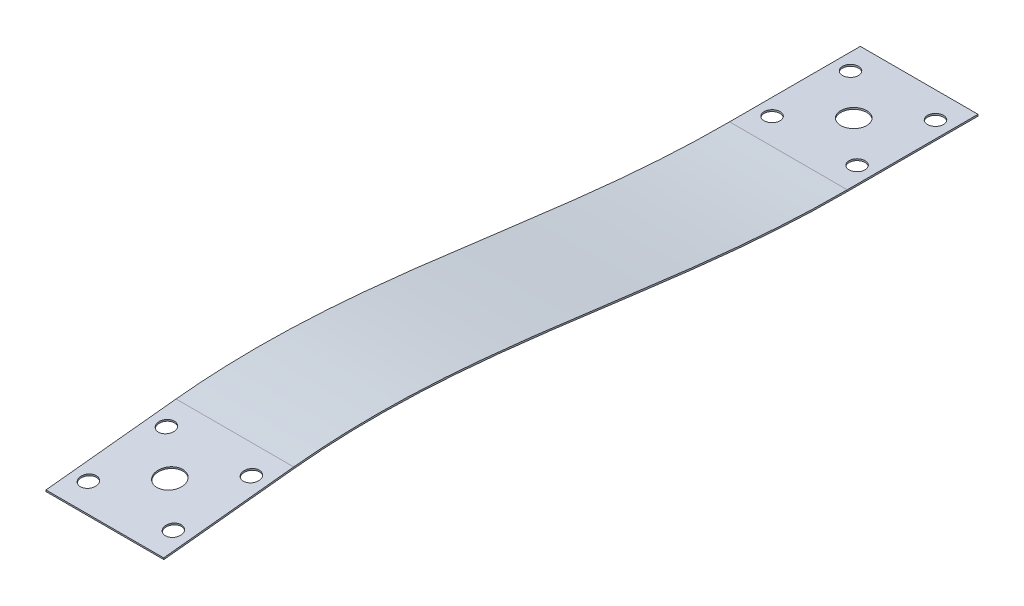
ISO-10303-21;
HEADER;
FILE_DESCRIPTION(('STEP AP214'),'2;1');
FILE_NAME('part.step','',(''),(''),'','','');
FILE_SCHEMA(('AUTOMOTIVE_DESIGN { 1 0 10303 214 1 1 1 1 }'));
ENDSEC;
DATA;
#1=APPLICATION_CONTEXT('core data for automotive mechanical design processes');
#2=APPLICATION_PROTOCOL_DEFINITION('international standard','automotive_design',2000,#1);
#3=PRODUCT_CONTEXT('',#1,'mechanical');
#4=PRODUCT('Part','Part','',(#3));
#5=PRODUCT_RELATED_PRODUCT_CATEGORY('part','',(#4));
#6=PRODUCT_DEFINITION_FORMATION('','',#4);
#7=PRODUCT_DEFINITION_CONTEXT('part definition',#1,'design');
#8=PRODUCT_DEFINITION('design','',#6,#7);
#9=PRODUCT_DEFINITION_SHAPE('','',#8);
#10=(LENGTH_UNIT() NAMED_UNIT(*) SI_UNIT(.MILLI.,.METRE.));
#11=(NAMED_UNIT(*) PLANE_ANGLE_UNIT() SI_UNIT($,.RADIAN.));
#12=(NAMED_UNIT(*) SI_UNIT($,.STERADIAN.) SOLID_ANGLE_UNIT());
#13=UNCERTAINTY_MEASURE_WITH_UNIT(LENGTH_MEASURE(1.E-05),#10,'distance_accuracy_value','');
#14=(GEOMETRIC_REPRESENTATION_CONTEXT(3) GLOBAL_UNCERTAINTY_ASSIGNED_CONTEXT((#13)) GLOBAL_UNIT_ASSIGNED_CONTEXT((#10,
#11,#12)) REPRESENTATION_CONTEXT('',''));
#15=CARTESIAN_POINT('',(0.,0.,0.));
#16=DIRECTION('',(0.,0.,1.));
#17=DIRECTION('',(1.,0.,0.));
#18=AXIS2_PLACEMENT_3D('',#15,#16,#17);
#19=CARTESIAN_POINT('',(9.,5.74729757336504,84.6633387766344));
#20=DIRECTION('',(0.,-0.994469081614486,-0.105029737278733));
#21=DIRECTION('',(0.,0.105029737278733,-0.994469081614487));
#22=AXIS2_PLACEMENT_3D('',#19,#20,#21);
#23=PLANE('',#22);
#24=CARTESIAN_POINT('',(0.,4.69700020057771,94.6080295927793));
#25=DIRECTION('',(0.,0.994469081614487,0.105029737278733));
#26=DIRECTION('',(0.,-0.105029737278733,0.994469081614487));
#27=AXIS2_PLACEMENT_3D('',#24,#25,#26);
#28=CIRCLE('',#27,1.98437499999999);
#29=CARTESIAN_POINT('',(0.,4.48858181566522,96.5814291766081));
#30=VERTEX_POINT('',#29);
#31=EDGE_CURVE('E218',#30,#30,#28,.T.);
#32=ORIENTED_EDGE('',*,*,#31,.F.);
#33=EDGE_LOOP('',(#32));
#34=FACE_BOUND('',#33,.T.);
#35=CARTESIAN_POINT('',(-6.5,5.32717862425011,88.6412151030924));
#36=DIRECTION('',(0.,0.994469081614487,0.105029737278733));
#37=DIRECTION('',(0.,-0.105029737278733,0.994469081614487));
#38=AXIS2_PLACEMENT_3D('',#35,#36,#37);
#39=CIRCLE('',#38,1.21919999999999);
#40=CARTESIAN_POINT('',(-6.5,5.19912636855988,89.8536718073967));
#41=VERTEX_POINT('',#40);
#42=EDGE_CURVE('E215',#41,#41,#39,.T.);
#43=ORIENTED_EDGE('',*,*,#42,.F.);
#44=EDGE_LOOP('',(#43));
#45=FACE_BOUND('',#44,.T.);
#46=CARTESIAN_POINT('',(-6.5,4.06682177690531,100.574844082466));
#47=DIRECTION('',(0.,0.994469081614487,0.105029737278733));
#48=DIRECTION('',(0.,-0.105029737278733,0.994469081614487));
#49=AXIS2_PLACEMENT_3D('',#46,#47,#48);
#50=CIRCLE('',#49,1.21919999999999);
#51=CARTESIAN_POINT('',(-6.5,3.93876952121508,101.787300786771));
#52=VERTEX_POINT('',#51);
#53=EDGE_CURVE('E211',#52,#52,#50,.T.);
#54=ORIENTED_EDGE('',*,*,#53,.F.);
#55=EDGE_LOOP('',(#54));
#56=FACE_BOUND('',#55,.T.);
#57=CARTESIAN_POINT('',(6.50000000000001,4.06682177690531,100.574844082466));
#58=DIRECTION('',(0.,0.994469081614487,0.105029737278733));
#59=DIRECTION('',(0.,-0.105029737278733,0.994469081614487));
#60=AXIS2_PLACEMENT_3D('',#57,#58,#59);
#61=CIRCLE('',#60,1.21919999999999);
#62=CARTESIAN_POINT('',(6.50000000000001,3.93876952121508,101.787300786771));
#63=VERTEX_POINT('',#62);
#64=EDGE_CURVE('E207',#63,#63,#61,.T.);
#65=ORIENTED_EDGE('',*,*,#64,.F.);
#66=EDGE_LOOP('',(#65));
#67=FACE_BOUND('',#66,.T.);
#68=CARTESIAN_POINT('',(6.50000000000001,5.32717862425011,88.6412151030924));
#69=DIRECTION('',(0.,0.994469081614487,0.105029737278733));
#70=DIRECTION('',(0.,-0.105029737278733,0.994469081614487));
#71=AXIS2_PLACEMENT_3D('',#68,#69,#70);
#72=CIRCLE('',#71,1.21919999999999);
#73=CARTESIAN_POINT('',(6.50000000000001,5.19912636855988,89.8536718073967));
#74=VERTEX_POINT('',#73);
#75=EDGE_CURVE('E201',#74,#74,#72,.T.);
#76=ORIENTED_EDGE('',*,*,#75,.F.);
#77=EDGE_LOOP('',(#76));
#78=FACE_BOUND('',#77,.T.);
#79=DIRECTION('',(0.,-0.105029737278733,0.994469081614487));
#80=VECTOR('',#79,1.);
#81=CARTESIAN_POINT('',(-9.,5.74729757336504,84.6633387766344));
#82=LINE('',#81,#80);
#83=CARTESIAN_POINT('',(-9.,5.74729757336504,84.6633387766344));
#84=VERTEX_POINT('',#83);
#85=CARTESIAN_POINT('',(-9.,3.64670282779038,104.552720408924));
#86=VERTEX_POINT('',#85);
#87=EDGE_CURVE('E135',#84,#86,#82,.T.);
#88=ORIENTED_EDGE('',*,*,#87,.T.);
#89=DIRECTION('',(-1.,0.,0.));
#90=VECTOR('',#89,1.);
#91=CARTESIAN_POINT('',(9.,3.64670282779038,104.552720408924));
#92=LINE('',#91,#90);
#93=CARTESIAN_POINT('',(9.,3.64670282779038,104.552720408924));
#94=VERTEX_POINT('',#93);
#95=EDGE_CURVE('E11',#94,#86,#92,.T.);
#96=ORIENTED_EDGE('',*,*,#95,.F.);
#97=DIRECTION('',(0.,-0.105029737278733,0.994469081614487));
#98=VECTOR('',#97,1.);
#99=CARTESIAN_POINT('',(9.,5.74729757336504,84.6633387766344));
#100=LINE('',#99,#98);
#101=CARTESIAN_POINT('',(9.,5.74729757336504,84.6633387766344));
#102=VERTEX_POINT('',#101);
#103=EDGE_CURVE('E90',#102,#94,#100,.T.);
#104=ORIENTED_EDGE('',*,*,#103,.F.);
#105=DIRECTION('',(-1.,0.,0.));
#106=VECTOR('',#105,1.);
#107=CARTESIAN_POINT('',(9.,5.74729757336504,84.6633387766344));
#108=LINE('',#107,#106);
#109=EDGE_CURVE('E134',#102,#84,#108,.T.);
#110=ORIENTED_EDGE('',*,*,#109,.T.);
#111=EDGE_LOOP('',(#88,#96,#104,#110));
#112=FACE_BOUND('',#111,.T.);
#113=ADVANCED_FACE('F33',(#34,#45,#56,#67,#78,#112),#23,.F.);
#114=CARTESIAN_POINT('',(9.,3.3941076810603,104.526042855655));
#115=DIRECTION('',(0.,-0.105029737278719,0.994469081614488));
#116=DIRECTION('',(0.,-0.994469081614488,-0.105029737278719));
#117=AXIS2_PLACEMENT_3D('',#114,#115,#116);
#118=PLANE('',#117);
#119=DIRECTION('',(0.,0.994469081614488,0.105029737278719));
#120=VECTOR('',#119,1.);
#121=CARTESIAN_POINT('',(-9.,3.3941076810603,104.526042855655));
#122=LINE('',#121,#120);
#123=CARTESIAN_POINT('',(-9.,3.3941076810603,104.526042855655));
#124=VERTEX_POINT('',#123);
#125=EDGE_CURVE('E271',#124,#86,#122,.T.);
#126=ORIENTED_EDGE('',*,*,#125,.F.);
#127=DIRECTION('',(-1.,0.,0.));
#128=VECTOR('',#127,1.);
#129=CARTESIAN_POINT('',(9.,3.3941076810603,104.526042855655));
#130=LINE('',#129,#128);
#131=CARTESIAN_POINT('',(9.,3.3941076810603,104.526042855655));
#132=VERTEX_POINT('',#131);
#133=EDGE_CURVE('E42',#132,#124,#130,.T.);
#134=ORIENTED_EDGE('',*,*,#133,.F.);
#135=DIRECTION('',(0.,0.994469081614488,0.105029737278719));
#136=VECTOR('',#135,1.);
#137=CARTESIAN_POINT('',(9.,3.3941076810603,104.526042855655));
#138=LINE('',#137,#136);
#139=EDGE_CURVE('E172',#132,#94,#138,.T.);
#140=ORIENTED_EDGE('',*,*,#139,.T.);
#141=ORIENTED_EDGE('',*,*,#95,.T.);
#142=EDGE_LOOP('',(#126,#134,#140,#141));
#143=FACE_BOUND('',#142,.T.);
#144=ADVANCED_FACE('F252',(#143),#118,.T.);
#145=CARTESIAN_POINT('',(9.,5.49470242663496,84.6366612233656));
#146=DIRECTION('',(0.,-0.994469081614486,-0.105029737278733));
#147=DIRECTION('',(0.,0.105029737278733,-0.994469081614487));
#148=AXIS2_PLACEMENT_3D('',#145,#146,#147);
#149=PLANE('',#148);
#150=CARTESIAN_POINT('',(0.,4.44440505384762,94.5813520395105));
#151=DIRECTION('',(0.,-0.994469081614486,-0.105029737278733));
#152=DIRECTION('',(0.,0.105029737278733,-0.994469081614487));
#153=AXIS2_PLACEMENT_3D('',#150,#151,#152);
#154=CIRCLE('',#153,1.98437499999999);
#155=CARTESIAN_POINT('',(0.,4.65282343876011,92.6079524556818));
#156=VERTEX_POINT('',#155);
#157=EDGE_CURVE('E36',#156,#156,#154,.T.);
#158=ORIENTED_EDGE('',*,*,#157,.F.);
#159=EDGE_LOOP('',(#158));
#160=FACE_BOUND('',#159,.T.);
#161=CARTESIAN_POINT('',(-6.5,5.07458347752003,88.6145375498236));
#162=DIRECTION('',(0.,-0.994469081614486,-0.105029737278733));
#163=DIRECTION('',(0.,0.105029737278733,-0.994469081614487));
#164=AXIS2_PLACEMENT_3D('',#161,#162,#163);
#165=CIRCLE('',#164,1.21919999999998);
#166=CARTESIAN_POINT('',(-6.5,5.20263573321026,87.4020808455192));
#167=VERTEX_POINT('',#166);
#168=EDGE_CURVE('E214',#167,#167,#165,.T.);
#169=ORIENTED_EDGE('',*,*,#168,.F.);
#170=EDGE_LOOP('',(#169));
#171=FACE_BOUND('',#170,.T.);
#172=CARTESIAN_POINT('',(-6.5,3.81422663017523,100.548166529197));
#173=DIRECTION('',(0.,-0.994469081614486,-0.105029737278733));
#174=DIRECTION('',(0.,0.105029737278733,-0.994469081614487));
#175=AXIS2_PLACEMENT_3D('',#172,#173,#174);
#176=CIRCLE('',#175,1.21919999999998);
#177=CARTESIAN_POINT('',(-6.5,3.94227888586546,99.3357098248931));
#178=VERTEX_POINT('',#177);
#179=EDGE_CURVE('E210',#178,#178,#176,.T.);
#180=ORIENTED_EDGE('',*,*,#179,.F.);
#181=EDGE_LOOP('',(#180));
#182=FACE_BOUND('',#181,.T.);
#183=CARTESIAN_POINT('',(6.50000000000001,3.81422663017523,100.548166529197));
#184=DIRECTION('',(0.,-0.994469081614486,-0.105029737278733));
#185=DIRECTION('',(0.,0.105029737278733,-0.994469081614487));
#186=AXIS2_PLACEMENT_3D('',#183,#184,#185);
#187=CIRCLE('',#186,1.21919999999998);
#188=CARTESIAN_POINT('',(6.50000000000001,3.94227888586546,99.3357098248931));
#189=VERTEX_POINT('',#188);
#190=EDGE_CURVE('E204',#189,#189,#187,.T.);
#191=ORIENTED_EDGE('',*,*,#190,.F.);
#192=EDGE_LOOP('',(#191));
#193=FACE_BOUND('',#192,.T.);
#194=CARTESIAN_POINT('',(6.50000000000001,5.07458347752003,88.6145375498236));
#195=DIRECTION('',(0.,-0.994469081614486,-0.105029737278733));
#196=DIRECTION('',(0.,0.105029737278733,-0.994469081614487));
#197=AXIS2_PLACEMENT_3D('',#194,#195,#196);
#198=CIRCLE('',#197,1.21919999999998);
#199=CARTESIAN_POINT('',(6.50000000000001,5.20263573321026,87.4020808455192));
#200=VERTEX_POINT('',#199);
#201=EDGE_CURVE('E200',#200,#200,#198,.T.);
#202=ORIENTED_EDGE('',*,*,#201,.F.);
#203=EDGE_LOOP('',(#202));
#204=FACE_BOUND('',#203,.T.);
#205=DIRECTION('',(0.,-0.105029737278733,0.994469081614487));
#206=VECTOR('',#205,1.);
#207=CARTESIAN_POINT('',(-9.,5.49470242663496,84.6366612233656));
#208=LINE('',#207,#206);
#209=CARTESIAN_POINT('',(-9.,5.49470242663496,84.6366612233656));
#210=VERTEX_POINT('',#209);
#211=EDGE_CURVE('E276',#210,#124,#208,.T.);
#212=ORIENTED_EDGE('',*,*,#211,.F.);
#213=DIRECTION('',(-1.,0.,0.));
#214=VECTOR('',#213,1.);
#215=CARTESIAN_POINT('',(9.,5.49470242663496,84.6366612233656));
#216=LINE('',#215,#214);
#217=CARTESIAN_POINT('',(9.,5.49470242663496,84.6366612233656));
#218=VERTEX_POINT('',#217);
#219=EDGE_CURVE('E302',#218,#210,#216,.T.);
#220=ORIENTED_EDGE('',*,*,#219,.F.);
#221=DIRECTION('',(0.,-0.105029737278733,0.994469081614487));
#222=VECTOR('',#221,1.);
#223=CARTESIAN_POINT('',(9.,5.49470242663496,84.6366612233656));
#224=LINE('',#223,#222);
#225=EDGE_CURVE('E166',#218,#132,#224,.T.);
#226=ORIENTED_EDGE('',*,*,#225,.T.);
#227=ORIENTED_EDGE('',*,*,#133,.T.);
#228=EDGE_LOOP('',(#212,#220,#226,#227));
#229=FACE_BOUND('',#228,.T.);
#230=ADVANCED_FACE('F159',(#160,#171,#182,#193,#204,#229),#149,.T.);
#231=CARTESIAN_POINT('',(9.,-0.127000105809204,-1.36583095115493E-10));
#232=CARTESIAN_POINT('',(9.,-0.128143021865844,0.885399053011757));
#233=CARTESIAN_POINT('',(9.,-0.123835370673403,1.77218525643978));
#234=CARTESIAN_POINT('',(9.,-0.0961288767604791,3.54431548819985));
#235=CARTESIAN_POINT('',(9.,-0.0742212508514387,4.43020210813132));
#236=CARTESIAN_POINT('',(9.,0.013381285742932,7.08704887302856));
#237=CARTESIAN_POINT('',(9.,0.101796599145457,8.85715975228982));
#238=CARTESIAN_POINT('',(9.,0.437391572950734,14.1622928781372));
#239=CARTESIAN_POINT('',(9.,0.759492990303279,17.6943971623569));
#240=CARTESIAN_POINT('',(9.,1.23368964575363,22.0947929516091));
#241=CARTESIAN_POINT('',(9.,1.33113581302159,22.9753169235342));
#242=CARTESIAN_POINT('',(9.,1.48307431174126,24.295662764479));
#243=CARTESIAN_POINT('',(9.,1.53553491489094,24.7354860446641));
#244=CARTESIAN_POINT('',(9.,1.64034509373615,25.6145735259548));
#245=CARTESIAN_POINT('',(9.,1.69188452769942,26.0543074637811));
#246=CARTESIAN_POINT('',(9.,1.95784903137852,28.2528501864154));
#247=CARTESIAN_POINT('',(9.,2.17957669419992,30.0098735174898));
#248=CARTESIAN_POINT('',(9.,2.63538255229505,33.5221851266791));
#249=CARTESIAN_POINT('',(9.,2.86375731884291,35.2778825577379));
#250=CARTESIAN_POINT('',(9.,3.15175490081175,37.4730564733073));
#251=CARTESIAN_POINT('',(9.,3.21017898954978,37.9119963749555));
#252=CARTESIAN_POINT('',(9.,3.32571220359216,38.7895146565585));
#253=CARTESIAN_POINT('',(9.,3.38141426420253,39.2281541352072));
#254=CARTESIAN_POINT('',(9.,3.49459679749619,40.106957705736));
#255=CARTESIAN_POINT('',(9.,3.55327014081306,40.5456155175945));
#256=CARTESIAN_POINT('',(9.,3.6661630868697,41.423347892593));
#257=CARTESIAN_POINT('',(9.,3.72160812093919,41.8625318125121));
#258=CARTESIAN_POINT('',(9.,3.88920136510726,43.180214497692));
#259=CARTESIAN_POINT('',(9.,3.99965236561597,44.0579171416497));
#260=CARTESIAN_POINT('',(9.,4.21731505323944,45.8157169665132));
#261=CARTESIAN_POINT('',(9.,4.32328115978713,46.6939930062905));
#262=CARTESIAN_POINT('',(9.,4.63619755880245,49.331349783349));
#263=CARTESIAN_POINT('',(9.,4.82937398651978,51.0905487832433));
#264=CARTESIAN_POINT('',(9.,5.10364199762843,53.7316841029352));
#265=CARTESIAN_POINT('',(9.,5.19114662776429,54.6122091612558));
#266=CARTESIAN_POINT('',(9.,5.35371462886484,56.3742787885319));
#267=CARTESIAN_POINT('',(9.,5.43289702791826,57.2558355362828));
#268=CARTESIAN_POINT('',(9.,5.6471224598932,59.901890663127));
#269=CARTESIAN_POINT('',(9.,5.7736562575613,61.667444938742));
#270=CARTESIAN_POINT('',(9.,6.06579371707129,66.9675283171832));
#271=CARTESIAN_POINT('',(9.,6.16275179256943,70.5079135399198));
#272=CARTESIAN_POINT('',(9.,6.08778210894618,75.8138940417899));
#273=CARTESIAN_POINT('',(9.,6.02629155840212,77.582332727326));
#274=CARTESIAN_POINT('',(9.,5.87526017602691,80.2315562749524));
#275=CARTESIAN_POINT('',(9.,5.81469665937375,81.1137031396494));
#276=CARTESIAN_POINT('',(9.,5.70709918650845,82.4360039450586));
#277=CARTESIAN_POINT('',(9.,5.66893171030934,82.876664731825));
#278=CARTESIAN_POINT('',(9.,5.58682710737154,83.756993459297));
#279=CARTESIAN_POINT('',(9.,5.54119929537122,84.1964078289638));
#280=CARTESIAN_POINT('',(9.,5.49470242663496,84.6366612233656));
#281=B_SPLINE_CURVE_WITH_KNOTS('',3,(#231,#232,#233,#234,#235,#236,#237,#238,#239,#240,#241,
#242,#243,#244,#245,#246,#247,#248,#249,#250,#251,#252,#253,#254,#255,#256,#257,#258,#259,#260,
#261,#262,#263,#264,#265,#266,#267,#268,#269,#270,#271,#272,#273,#274,#275,#276,#277,#278,#279,
#280),.UNSPECIFIED.,.F.,.F.,(4,2,2,2,2,2,2,2,2,2,2,2,2,2,2,2,2,2,2,2,2,2,2,2,4),(0.,
0.0312500000000001,0.0625000000000002,0.125,0.250000000000001,0.281250000000001,
0.296875000000001,0.312500000000001,0.375000000000001,0.437500000000001,0.453125000000001,
0.468750000000001,0.484375000000001,0.500000000000001,0.531250000000001,0.562500000000001,
0.625000000000001,0.656250000000001,0.687500000000001,0.75,0.875,0.9375,0.96875,0.984375,1.),.UNSPECIFIED.);
#282=DIRECTION('',(-1.,0.,0.));
#283=VECTOR('',#282,1.);
#284=SURFACE_OF_LINEAR_EXTRUSION('',#281,#283);
#285=CARTESIAN_POINT('',(-9.,-0.127000105809204,-1.36583095115493E-10));
#286=CARTESIAN_POINT('',(-9.,-0.128143021865844,0.885399053011757));
#287=CARTESIAN_POINT('',(-9.,-0.123835370673403,1.77218525643978));
#288=CARTESIAN_POINT('',(-9.,-0.0961288767604791,3.54431548819985));
#289=CARTESIAN_POINT('',(-9.,-0.0742212508514387,4.43020210813132));
#290=CARTESIAN_POINT('',(-9.,0.013381285742932,7.08704887302856));
#291=CARTESIAN_POINT('',(-9.,0.101796599145457,8.85715975228982));
#292=CARTESIAN_POINT('',(-9.,0.437391572950734,14.1622928781372));
#293=CARTESIAN_POINT('',(-9.,0.759492990303279,17.6943971623569));
#294=CARTESIAN_POINT('',(-9.,1.23368964575363,22.0947929516091));
#295=CARTESIAN_POINT('',(-9.,1.33113581302159,22.9753169235342));
#296=CARTESIAN_POINT('',(-9.,1.48307431174126,24.295662764479));
#297=CARTESIAN_POINT('',(-9.,1.53553491489094,24.7354860446641));
#298=CARTESIAN_POINT('',(-9.,1.64034509373615,25.6145735259548));
#299=CARTESIAN_POINT('',(-9.,1.69188452769942,26.0543074637811));
#300=CARTESIAN_POINT('',(-9.,1.95784903137852,28.2528501864154));
#301=CARTESIAN_POINT('',(-9.,2.17957669419992,30.0098735174898));
#302=CARTESIAN_POINT('',(-9.,2.63538255229505,33.5221851266791));
#303=CARTESIAN_POINT('',(-9.,2.86375731884291,35.2778825577379));
#304=CARTESIAN_POINT('',(-9.,3.15175490081175,37.4730564733073));
#305=CARTESIAN_POINT('',(-9.,3.21017898954978,37.9119963749555));
#306=CARTESIAN_POINT('',(-9.,3.32571220359216,38.7895146565585));
#307=CARTESIAN_POINT('',(-9.,3.38141426420253,39.2281541352072));
#308=CARTESIAN_POINT('',(-9.,3.49459679749619,40.106957705736));
#309=CARTESIAN_POINT('',(-9.,3.55327014081306,40.5456155175945));
#310=CARTESIAN_POINT('',(-9.,3.6661630868697,41.423347892593));
#311=CARTESIAN_POINT('',(-9.,3.72160812093919,41.8625318125121));
#312=CARTESIAN_POINT('',(-9.,3.88920136510726,43.180214497692));
#313=CARTESIAN_POINT('',(-9.,3.99965236561597,44.0579171416497));
#314=CARTESIAN_POINT('',(-9.,4.21731505323944,45.8157169665132));
#315=CARTESIAN_POINT('',(-9.,4.32328115978713,46.6939930062905));
#316=CARTESIAN_POINT('',(-9.,4.63619755880245,49.331349783349));
#317=CARTESIAN_POINT('',(-9.,4.82937398651978,51.0905487832433));
#318=CARTESIAN_POINT('',(-9.,5.10364199762843,53.7316841029352));
#319=CARTESIAN_POINT('',(-9.,5.19114662776429,54.6122091612558));
#320=CARTESIAN_POINT('',(-9.,5.35371462886484,56.3742787885319));
#321=CARTESIAN_POINT('',(-9.,5.43289702791826,57.2558355362828));
#322=CARTESIAN_POINT('',(-9.,5.6471224598932,59.901890663127));
#323=CARTESIAN_POINT('',(-9.,5.7736562575613,61.667444938742));
#324=CARTESIAN_POINT('',(-9.,6.06579371707129,66.9675283171832));
#325=CARTESIAN_POINT('',(-9.,6.16275179256943,70.5079135399198));
#326=CARTESIAN_POINT('',(-9.,6.08778210894618,75.8138940417899));
#327=CARTESIAN_POINT('',(-9.,6.02629155840212,77.582332727326));
#328=CARTESIAN_POINT('',(-9.,5.87526017602691,80.2315562749524));
#329=CARTESIAN_POINT('',(-9.,5.81469665937375,81.1137031396494));
#330=CARTESIAN_POINT('',(-9.,5.70709918650845,82.4360039450586));
#331=CARTESIAN_POINT('',(-9.,5.66893171030934,82.876664731825));
#332=CARTESIAN_POINT('',(-9.,5.58682710737154,83.756993459297));
#333=CARTESIAN_POINT('',(-9.,5.54119929537122,84.1964078289638));
#334=CARTESIAN_POINT('',(-9.,5.49470242663496,84.6366612233656));
#335=B_SPLINE_CURVE_WITH_KNOTS('',3,(#285,#286,#287,#288,#289,#290,#291,#292,#293,#294,#295,
#296,#297,#298,#299,#300,#301,#302,#303,#304,#305,#306,#307,#308,#309,#310,#311,#312,#313,#314,
#315,#316,#317,#318,#319,#320,#321,#322,#323,#324,#325,#326,#327,#328,#329,#330,#331,#332,#333,
#334),.UNSPECIFIED.,.F.,.F.,(4,2,2,2,2,2,2,2,2,2,2,2,2,2,2,2,2,2,2,2,2,2,2,2,4),(0.,
0.0312500000000001,0.0625000000000002,0.125,0.250000000000001,0.281250000000001,
0.296875000000001,0.312500000000001,0.375000000000001,0.437500000000001,0.453125000000001,
0.468750000000001,0.484375000000001,0.500000000000001,0.531250000000001,0.562500000000001,
0.625000000000001,0.656250000000001,0.687500000000001,0.75,0.875,0.9375,0.96875,0.984375,1.),.UNSPECIFIED.);
#336=CARTESIAN_POINT('',(-9.,-0.127000105809204,-1.36583378977409E-10));
#337=VERTEX_POINT('',#336);
#338=EDGE_CURVE('E277',#337,#210,#335,.T.);
#339=ORIENTED_EDGE('',*,*,#338,.F.);
#340=DIRECTION('',(-1.,0.,0.));
#341=VECTOR('',#340,1.);
#342=CARTESIAN_POINT('',(9.,-0.127000105809204,-1.36583378977409E-10));
#343=LINE('',#342,#341);
#344=CARTESIAN_POINT('',(9.,-0.127000105809204,-1.36583378977409E-10));
#345=VERTEX_POINT('',#344);
#346=EDGE_CURVE('E300',#345,#337,#343,.T.);
#347=ORIENTED_EDGE('',*,*,#346,.F.);
#348=EDGE_CURVE('E126',#345,#218,#281,.T.);
#349=ORIENTED_EDGE('',*,*,#348,.T.);
#350=ORIENTED_EDGE('',*,*,#219,.T.);
#351=EDGE_LOOP('',(#339,#347,#349,#350));
#352=FACE_BOUND('',#351,.T.);
#353=ADVANCED_FACE('F155',(#352),#284,.T.);
#354=CARTESIAN_POINT('',(9.,-0.127,0.));
#355=DIRECTION('',(0.,-1.,0.));
#356=DIRECTION('',(0.,0.,-1.));
#357=AXIS2_PLACEMENT_3D('',#354,#355,#356);
#358=PLANE('',#357);
#359=CARTESIAN_POINT('',(0.,-0.127,-9.99999999993171));
#360=DIRECTION('',(0.,-1.,0.));
#361=DIRECTION('',(0.,0.,-1.));
#362=AXIS2_PLACEMENT_3D('',#359,#360,#361);
#363=CIRCLE('',#362,1.98437499999999);
#364=CARTESIAN_POINT('',(0.,-0.127,-11.9843749999317));
#365=VERTEX_POINT('',#364);
#366=EDGE_CURVE('E221',#365,#365,#363,.T.);
#367=ORIENTED_EDGE('',*,*,#366,.F.);
#368=EDGE_LOOP('',(#367));
#369=FACE_BOUND('',#368,.T.);
#370=CARTESIAN_POINT('',(-6.5,-0.127,-15.9999999999317));
#371=DIRECTION('',(0.,-1.,0.));
#372=DIRECTION('',(0.,0.,-1.));
#373=AXIS2_PLACEMENT_3D('',#370,#371,#372);
#374=CIRCLE('',#373,1.21919999999998);
#375=CARTESIAN_POINT('',(-6.5,-0.127,-17.2191999999317));
#376=VERTEX_POINT('',#375);
#377=EDGE_CURVE('E194',#376,#376,#374,.T.);
#378=ORIENTED_EDGE('',*,*,#377,.F.);
#379=EDGE_LOOP('',(#378));
#380=FACE_BOUND('',#379,.T.);
#381=CARTESIAN_POINT('',(-6.5,-0.127,-3.99999999993171));
#382=DIRECTION('',(0.,-1.,0.));
#383=DIRECTION('',(0.,0.,-1.));
#384=AXIS2_PLACEMENT_3D('',#381,#382,#383);
#385=CIRCLE('',#384,1.21919999999998);
#386=CARTESIAN_POINT('',(-6.5,-0.127,-5.21919999993169));
#387=VERTEX_POINT('',#386);
#388=EDGE_CURVE('E188',#387,#387,#385,.T.);
#389=ORIENTED_EDGE('',*,*,#388,.F.);
#390=EDGE_LOOP('',(#389));
#391=FACE_BOUND('',#390,.T.);
#392=CARTESIAN_POINT('',(6.49999999999999,-0.127,-15.9999999999317));
#393=DIRECTION('',(0.,-1.,0.));
#394=DIRECTION('',(0.,0.,-1.));
#395=AXIS2_PLACEMENT_3D('',#392,#393,#394);
#396=CIRCLE('',#395,1.21919999999998);
#397=CARTESIAN_POINT('',(6.49999999999999,-0.127,-17.2191999999317));
#398=VERTEX_POINT('',#397);
#399=EDGE_CURVE('E182',#398,#398,#396,.T.);
#400=ORIENTED_EDGE('',*,*,#399,.F.);
#401=EDGE_LOOP('',(#400));
#402=FACE_BOUND('',#401,.T.);
#403=CARTESIAN_POINT('',(6.5,-0.127,-3.99999999993171));
#404=DIRECTION('',(0.,-1.,0.));
#405=DIRECTION('',(0.,0.,-1.));
#406=AXIS2_PLACEMENT_3D('',#403,#404,#405);
#407=CIRCLE('',#406,1.21919999999998);
#408=CARTESIAN_POINT('',(6.5,-0.127,-5.21919999993169));
#409=VERTEX_POINT('',#408);
#410=EDGE_CURVE('E176',#409,#409,#407,.T.);
#411=ORIENTED_EDGE('',*,*,#410,.F.);
#412=EDGE_LOOP('',(#411));
#413=FACE_BOUND('',#412,.T.);
#414=DIRECTION('',(0.,0.,-1.));
#415=VECTOR('',#414,1.);
#416=CARTESIAN_POINT('',(-9.,-0.127,0.));
#417=LINE('',#416,#415);
#418=CARTESIAN_POINT('',(-9.,-0.127,-20.));
#419=VERTEX_POINT('',#418);
#420=EDGE_CURVE('E283',#419,#337,#417,.F.);
#421=ORIENTED_EDGE('',*,*,#420,.F.);
#422=DIRECTION('',(-1.,0.,0.));
#423=VECTOR('',#422,1.);
#424=CARTESIAN_POINT('',(9.,-0.127,-20.));
#425=LINE('',#424,#423);
#426=CARTESIAN_POINT('',(9.,-0.127,-20.));
#427=VERTEX_POINT('',#426);
#428=EDGE_CURVE('E114',#427,#419,#425,.T.);
#429=ORIENTED_EDGE('',*,*,#428,.F.);
#430=DIRECTION('',(0.,0.,-1.));
#431=VECTOR('',#430,1.);
#432=CARTESIAN_POINT('',(9.,-0.127,0.));
#433=LINE('',#432,#431);
#434=EDGE_CURVE('E124',#427,#345,#433,.F.);
#435=ORIENTED_EDGE('',*,*,#434,.T.);
#436=ORIENTED_EDGE('',*,*,#346,.T.);
#437=EDGE_LOOP('',(#421,#429,#435,#436));
#438=FACE_BOUND('',#437,.T.);
#439=ADVANCED_FACE('F152',(#369,#380,#391,#402,#413,#438),#358,.T.);
#440=CARTESIAN_POINT('',(9.,0.127,-20.));
#441=DIRECTION('',(0.,0.,-1.));
#442=DIRECTION('',(-1.,0.,0.));
#443=AXIS2_PLACEMENT_3D('',#440,#441,#442);
#444=PLANE('',#443);
#445=DIRECTION('',(0.,-1.,0.));
#446=VECTOR('',#445,1.);
#447=CARTESIAN_POINT('',(-9.,0.127,-20.));
#448=LINE('',#447,#446);
#449=CARTESIAN_POINT('',(-9.,0.127,-20.));
#450=VERTEX_POINT('',#449);
#451=EDGE_CURVE('E113',#450,#419,#448,.T.);
#452=ORIENTED_EDGE('',*,*,#451,.F.);
#453=DIRECTION('',(-1.,0.,0.));
#454=VECTOR('',#453,1.);
#455=CARTESIAN_POINT('',(9.,0.127,-20.));
#456=LINE('',#455,#454);
#457=CARTESIAN_POINT('',(9.,0.127,-20.));
#458=VERTEX_POINT('',#457);
#459=EDGE_CURVE('E107',#458,#450,#456,.T.);
#460=ORIENTED_EDGE('',*,*,#459,.F.);
#461=DIRECTION('',(0.,-1.,0.));
#462=VECTOR('',#461,1.);
#463=CARTESIAN_POINT('',(9.,0.127,-20.));
#464=LINE('',#463,#462);
#465=EDGE_CURVE('E111',#458,#427,#464,.T.);
#466=ORIENTED_EDGE('',*,*,#465,.T.);
#467=ORIENTED_EDGE('',*,*,#428,.T.);
#468=EDGE_LOOP('',(#452,#460,#466,#467));
#469=FACE_BOUND('',#468,.T.);
#470=ADVANCED_FACE('F109',(#469),#444,.T.);
#471=CARTESIAN_POINT('',(9.,0.127,0.));
#472=DIRECTION('',(0.,-1.,0.));
#473=DIRECTION('',(0.,0.,-1.));
#474=AXIS2_PLACEMENT_3D('',#471,#472,#473);
#475=PLANE('',#474);
#476=CARTESIAN_POINT('',(0.,0.127000000000001,-9.99999999993171));
#477=DIRECTION('',(0.,1.,0.));
#478=DIRECTION('',(0.,0.,1.));
#479=AXIS2_PLACEMENT_3D('',#476,#477,#478);
#480=CIRCLE('',#479,1.98437499999999);
#481=CARTESIAN_POINT('',(0.,0.127000000000001,-8.01562499993172));
#482=VERTEX_POINT('',#481);
#483=EDGE_CURVE('E224',#482,#482,#480,.T.);
#484=ORIENTED_EDGE('',*,*,#483,.F.);
#485=EDGE_LOOP('',(#484));
#486=FACE_BOUND('',#485,.T.);
#487=CARTESIAN_POINT('',(-6.5,0.127000000000001,-15.9999999999317));
#488=DIRECTION('',(0.,1.,0.));
#489=DIRECTION('',(0.,0.,1.));
#490=AXIS2_PLACEMENT_3D('',#487,#488,#489);
#491=CIRCLE('',#490,1.21919999999999);
#492=CARTESIAN_POINT('',(-6.5,0.127000000000001,-14.7807999999317));
#493=VERTEX_POINT('',#492);
#494=EDGE_CURVE('E197',#493,#493,#491,.T.);
#495=ORIENTED_EDGE('',*,*,#494,.F.);
#496=EDGE_LOOP('',(#495));
#497=FACE_BOUND('',#496,.T.);
#498=CARTESIAN_POINT('',(-6.5,0.127000000000001,-3.99999999993171));
#499=DIRECTION('',(0.,1.,0.));
#500=DIRECTION('',(0.,0.,1.));
#501=AXIS2_PLACEMENT_3D('',#498,#499,#500);
#502=CIRCLE('',#501,1.21919999999999);
#503=CARTESIAN_POINT('',(-6.5,0.127000000000001,-2.78079999993172));
#504=VERTEX_POINT('',#503);
#505=EDGE_CURVE('E191',#504,#504,#502,.T.);
#506=ORIENTED_EDGE('',*,*,#505,.F.);
#507=EDGE_LOOP('',(#506));
#508=FACE_BOUND('',#507,.T.);
#509=CARTESIAN_POINT('',(6.49999999999999,0.127000000000001,-15.9999999999317));
#510=DIRECTION('',(0.,1.,0.));
#511=DIRECTION('',(0.,0.,1.));
#512=AXIS2_PLACEMENT_3D('',#509,#510,#511);
#513=CIRCLE('',#512,1.21919999999999);
#514=CARTESIAN_POINT('',(6.49999999999999,0.127000000000001,-14.7807999999317));
#515=VERTEX_POINT('',#514);
#516=EDGE_CURVE('E185',#515,#515,#513,.T.);
#517=ORIENTED_EDGE('',*,*,#516,.F.);
#518=EDGE_LOOP('',(#517));
#519=FACE_BOUND('',#518,.T.);
#520=CARTESIAN_POINT('',(6.5,0.127000000000001,-3.99999999993171));
#521=DIRECTION('',(0.,1.,0.));
#522=DIRECTION('',(0.,0.,1.));
#523=AXIS2_PLACEMENT_3D('',#520,#521,#522);
#524=CIRCLE('',#523,1.21919999999999);
#525=CARTESIAN_POINT('',(6.5,0.127000000000001,-2.78079999993172));
#526=VERTEX_POINT('',#525);
#527=EDGE_CURVE('E179',#526,#526,#524,.T.);
#528=ORIENTED_EDGE('',*,*,#527,.F.);
#529=EDGE_LOOP('',(#528));
#530=FACE_BOUND('',#529,.T.);
#531=DIRECTION('',(0.,0.,-1.));
#532=VECTOR('',#531,1.);
#533=CARTESIAN_POINT('',(-9.,0.127,0.));
#534=LINE('',#533,#532);
#535=CARTESIAN_POINT('',(-9.,0.127000105809212,1.36583701008748E-10));
#536=VERTEX_POINT('',#535);
#537=EDGE_CURVE('E78',#450,#536,#534,.F.);
#538=ORIENTED_EDGE('',*,*,#537,.T.);
#539=DIRECTION('',(-1.,0.,0.));
#540=VECTOR('',#539,1.);
#541=CARTESIAN_POINT('',(9.,0.127000105809212,1.36583701008748E-10));
#542=LINE('',#541,#540);
#543=CARTESIAN_POINT('',(9.,0.127000105809212,1.36583701008748E-10));
#544=VERTEX_POINT('',#543);
#545=EDGE_CURVE('E115',#544,#536,#542,.T.);
#546=ORIENTED_EDGE('',*,*,#545,.F.);
#547=DIRECTION('',(0.,0.,-1.));
#548=VECTOR('',#547,1.);
#549=CARTESIAN_POINT('',(9.,0.127,0.));
#550=LINE('',#549,#548);
#551=EDGE_CURVE('E117',#458,#544,#550,.F.);
#552=ORIENTED_EDGE('',*,*,#551,.F.);
#553=ORIENTED_EDGE('',*,*,#459,.T.);
#554=EDGE_LOOP('',(#538,#546,#552,#553));
#555=FACE_BOUND('',#554,.T.);
#556=ADVANCED_FACE('F118',(#486,#497,#508,#519,#530,#555),#475,.F.);
#557=CARTESIAN_POINT('',(9.,0.127000105809212,1.36583701008748E-10));
#558=CARTESIAN_POINT('',(9.,0.125857185471394,0.885402271041204));
#559=CARTESIAN_POINT('',(9.,0.130154769464975,1.76944511906819));
#560=CARTESIAN_POINT('',(9.,0.157808985419354,3.53847961180576));
#561=CARTESIAN_POINT('',(9.,0.179678306671393,4.42291819639527));
#562=CARTESIAN_POINT('',(9.,0.267137929599099,7.07558447725196));
#563=CARTESIAN_POINT('',(9.,0.355414997031612,8.84306155441796));
#564=CARTESIAN_POINT('',(9.,0.578858606053435,12.3753698596638));
#565=CARTESIAN_POINT('',(9.,0.715295145126199,14.1403309769028));
#566=CARTESIAN_POINT('',(9.,0.948710472162718,16.7842581652076));
#567=CARTESIAN_POINT('',(9.,1.03157169619109,17.6651612109186));
#568=CARTESIAN_POINT('',(9.,1.1631343462366,18.9865292441906));
#569=CARTESIAN_POINT('',(9.,1.20695015819845,19.4271025572334));
#570=CARTESIAN_POINT('',(9.,1.29660584298699,20.3074183000043));
#571=CARTESIAN_POINT('',(9.,1.34391774466003,20.7469906621101));
#572=CARTESIAN_POINT('',(9.,1.48625011784758,22.0677842213129));
#573=CARTESIAN_POINT('',(9.,1.58359148199242,22.9473198200295));
#574=CARTESIAN_POINT('',(9.,1.7353082367339,24.2657543513241));
#575=CARTESIAN_POINT('',(9.,1.78771124272612,24.7051024833258));
#576=CARTESIAN_POINT('',(9.,1.89254164223842,25.5843582902471));
#577=CARTESIAN_POINT('',(9.,1.94407113320139,26.0240064247107));
#578=CARTESIAN_POINT('',(9.,2.20977518743771,28.2204121571168));
#579=CARTESIAN_POINT('',(9.,2.4314601933137,29.9771507932202));
#580=CARTESIAN_POINT('',(9.,2.88722192331072,33.4891245849944));
#581=CARTESIAN_POINT('',(9.,3.11567758265706,35.2454352160094));
#582=CARTESIAN_POINT('',(9.,3.40354717033799,37.4396390423879));
#583=CARTESIAN_POINT('',(9.,3.46194191027789,37.8783577140201));
#584=CARTESIAN_POINT('',(9.,3.57755601910825,38.7564871055677));
#585=CARTESIAN_POINT('',(9.,3.63339657973811,39.1961950265092));
#586=CARTESIAN_POINT('',(9.,3.74640854682948,40.0736813826368));
#587=CARTESIAN_POINT('',(9.,3.80511740954928,40.5126129019773));
#588=CARTESIAN_POINT('',(9.,3.91812221351306,41.3912104260792));
#589=CARTESIAN_POINT('',(9.,3.9735745368785,41.8304542418805));
#590=CARTESIAN_POINT('',(9.,4.14111693076142,43.1477391995203));
#591=CARTESIAN_POINT('',(9.,4.25176110650794,44.0269754170578));
#592=CARTESIAN_POINT('',(9.,4.46931817039173,45.7839264899407));
#593=CARTESIAN_POINT('',(9.,4.57546788710374,46.663695663745));
#594=CARTESIAN_POINT('',(9.,4.88846592048472,49.3017372237664));
#595=CARTESIAN_POINT('',(9.,5.08188394760422,51.0630524816711));
#596=CARTESIAN_POINT('',(9.,5.35633012763681,53.7058955242106));
#597=CARTESIAN_POINT('',(9.,5.44394700359317,54.5875203291918));
#598=CARTESIAN_POINT('',(9.,5.60674522451134,56.3520732807702));
#599=CARTESIAN_POINT('',(9.,5.68597974500623,57.2342452954775));
#600=CARTESIAN_POINT('',(9.,5.90044712533708,59.883274032638));
#601=CARTESIAN_POINT('',(9.,6.02710951613738,61.6505474957399));
#602=CARTESIAN_POINT('',(9.,6.31971875147755,66.9591401423368));
#603=CARTESIAN_POINT('',(9.,6.4168368034357,70.5036015068624));
#604=CARTESIAN_POINT('',(9.,6.34170244792782,75.8213712381477));
#605=CARTESIAN_POINT('',(9.,6.28008380665159,77.5932061778409));
#606=CARTESIAN_POINT('',(9.,6.12874816363237,80.2477743064028));
#607=CARTESIAN_POINT('',(9.,6.0680151724402,81.1323943285659));
#608=CARTESIAN_POINT('',(9.,5.96018604864599,82.4575433888989));
#609=CARTESIAN_POINT('',(9.,5.92195114414911,82.8989972433308));
#610=CARTESIAN_POINT('',(9.,5.8396135131533,83.7818250518296));
#611=CARTESIAN_POINT('',(9.,5.79379462145974,84.2230836839857));
#612=CARTESIAN_POINT('',(9.,5.74729757336504,84.6633387766344));
#613=B_SPLINE_CURVE_WITH_KNOTS('',3,(#557,#558,#559,#560,#561,#562,#563,#564,#565,#566,#567,
#568,#569,#570,#571,#572,#573,#574,#575,#576,#577,#578,#579,#580,#581,#582,#583,#584,#585,#586,
#587,#588,#589,#590,#591,#592,#593,#594,#595,#596,#597,#598,#599,#600,#601,#602,#603,#604,#605,
#606,#607,#608,#609,#610,#611,#612),.UNSPECIFIED.,.F.,.F.,(4,2,2,2,2,2,2,2,2,2,2,2,2,2,2,2,2,2,
2,2,2,2,2,2,2,2,2,4),(0.,0.0312499999999996,0.0624999999999993,0.124999999999999,
0.187499999999998,0.218749999999998,0.234374999999997,0.249999999999997,0.281249999999997,
0.296874999999997,0.312499999999997,0.374999999999996,0.437499999999996,0.453124999999996,
0.468749999999996,0.484374999999996,0.499999999999996,0.531249999999996,0.562499999999996,
0.624999999999997,0.656249999999997,0.687499999999997,0.749999999999998,0.874999999999999,
0.937499999999999,0.96875,0.984375,1.),.UNSPECIFIED.);
#614=DIRECTION('',(-1.,0.,0.));
#615=VECTOR('',#614,1.);
#616=SURFACE_OF_LINEAR_EXTRUSION('',#613,#615);
#617=CARTESIAN_POINT('',(-9.,0.127000105809212,1.36583701008748E-10));
#618=CARTESIAN_POINT('',(-9.,0.125857185471394,0.885402271041204));
#619=CARTESIAN_POINT('',(-9.,0.130154769464975,1.76944511906819));
#620=CARTESIAN_POINT('',(-9.,0.157808985419354,3.53847961180576));
#621=CARTESIAN_POINT('',(-9.,0.179678306671393,4.42291819639527));
#622=CARTESIAN_POINT('',(-9.,0.267137929599099,7.07558447725196));
#623=CARTESIAN_POINT('',(-9.,0.355414997031612,8.84306155441796));
#624=CARTESIAN_POINT('',(-9.,0.578858606053435,12.3753698596638));
#625=CARTESIAN_POINT('',(-9.,0.715295145126199,14.1403309769028));
#626=CARTESIAN_POINT('',(-9.,0.948710472162718,16.7842581652076));
#627=CARTESIAN_POINT('',(-9.,1.03157169619109,17.6651612109186));
#628=CARTESIAN_POINT('',(-9.,1.1631343462366,18.9865292441906));
#629=CARTESIAN_POINT('',(-9.,1.20695015819845,19.4271025572334));
#630=CARTESIAN_POINT('',(-9.,1.29660584298699,20.3074183000043));
#631=CARTESIAN_POINT('',(-9.,1.34391774466003,20.7469906621101));
#632=CARTESIAN_POINT('',(-9.,1.48625011784758,22.0677842213129));
#633=CARTESIAN_POINT('',(-9.,1.58359148199242,22.9473198200295));
#634=CARTESIAN_POINT('',(-9.,1.7353082367339,24.2657543513241));
#635=CARTESIAN_POINT('',(-9.,1.78771124272612,24.7051024833258));
#636=CARTESIAN_POINT('',(-9.,1.89254164223842,25.5843582902471));
#637=CARTESIAN_POINT('',(-9.,1.94407113320139,26.0240064247107));
#638=CARTESIAN_POINT('',(-9.,2.20977518743771,28.2204121571168));
#639=CARTESIAN_POINT('',(-9.,2.4314601933137,29.9771507932202));
#640=CARTESIAN_POINT('',(-9.,2.88722192331072,33.4891245849944));
#641=CARTESIAN_POINT('',(-9.,3.11567758265706,35.2454352160094));
#642=CARTESIAN_POINT('',(-9.,3.40354717033799,37.4396390423879));
#643=CARTESIAN_POINT('',(-9.,3.46194191027789,37.8783577140201));
#644=CARTESIAN_POINT('',(-9.,3.57755601910825,38.7564871055677));
#645=CARTESIAN_POINT('',(-9.,3.63339657973811,39.1961950265092));
#646=CARTESIAN_POINT('',(-9.,3.74640854682948,40.0736813826368));
#647=CARTESIAN_POINT('',(-9.,3.80511740954928,40.5126129019773));
#648=CARTESIAN_POINT('',(-9.,3.91812221351306,41.3912104260792));
#649=CARTESIAN_POINT('',(-9.,3.9735745368785,41.8304542418805));
#650=CARTESIAN_POINT('',(-9.,4.14111693076142,43.1477391995203));
#651=CARTESIAN_POINT('',(-9.,4.25176110650794,44.0269754170578));
#652=CARTESIAN_POINT('',(-9.,4.46931817039173,45.7839264899407));
#653=CARTESIAN_POINT('',(-9.,4.57546788710374,46.663695663745));
#654=CARTESIAN_POINT('',(-9.,4.88846592048472,49.3017372237664));
#655=CARTESIAN_POINT('',(-9.,5.08188394760422,51.0630524816711));
#656=CARTESIAN_POINT('',(-9.,5.35633012763681,53.7058955242106));
#657=CARTESIAN_POINT('',(-9.,5.44394700359317,54.5875203291918));
#658=CARTESIAN_POINT('',(-9.,5.60674522451134,56.3520732807702));
#659=CARTESIAN_POINT('',(-9.,5.68597974500623,57.2342452954775));
#660=CARTESIAN_POINT('',(-9.,5.90044712533708,59.883274032638));
#661=CARTESIAN_POINT('',(-9.,6.02710951613738,61.6505474957399));
#662=CARTESIAN_POINT('',(-9.,6.31971875147755,66.9591401423368));
#663=CARTESIAN_POINT('',(-9.,6.4168368034357,70.5036015068624));
#664=CARTESIAN_POINT('',(-9.,6.34170244792782,75.8213712381477));
#665=CARTESIAN_POINT('',(-9.,6.28008380665159,77.5932061778409));
#666=CARTESIAN_POINT('',(-9.,6.12874816363237,80.2477743064028));
#667=CARTESIAN_POINT('',(-9.,6.0680151724402,81.1323943285659));
#668=CARTESIAN_POINT('',(-9.,5.96018604864599,82.4575433888989));
#669=CARTESIAN_POINT('',(-9.,5.92195114414911,82.8989972433308));
#670=CARTESIAN_POINT('',(-9.,5.8396135131533,83.7818250518296));
#671=CARTESIAN_POINT('',(-9.,5.79379462145974,84.2230836839857));
#672=CARTESIAN_POINT('',(-9.,5.74729757336504,84.6633387766344));
#673=B_SPLINE_CURVE_WITH_KNOTS('',3,(#617,#618,#619,#620,#621,#622,#623,#624,#625,#626,#627,
#628,#629,#630,#631,#632,#633,#634,#635,#636,#637,#638,#639,#640,#641,#642,#643,#644,#645,#646,
#647,#648,#649,#650,#651,#652,#653,#654,#655,#656,#657,#658,#659,#660,#661,#662,#663,#664,#665,
#666,#667,#668,#669,#670,#671,#672),.UNSPECIFIED.,.F.,.F.,(4,2,2,2,2,2,2,2,2,2,2,2,2,2,2,2,2,2,
2,2,2,2,2,2,2,2,2,4),(0.,0.0312499999999996,0.0624999999999993,0.124999999999999,
0.187499999999998,0.218749999999998,0.234374999999997,0.249999999999997,0.281249999999997,
0.296874999999997,0.312499999999997,0.374999999999996,0.437499999999996,0.453124999999996,
0.468749999999996,0.484374999999996,0.499999999999996,0.531249999999996,0.562499999999996,
0.624999999999997,0.656249999999997,0.687499999999997,0.749999999999998,0.874999999999999,
0.937499999999999,0.96875,0.984375,1.),.UNSPECIFIED.);
#674=EDGE_CURVE('E84',#536,#84,#673,.T.);
#675=ORIENTED_EDGE('',*,*,#674,.T.);
#676=ORIENTED_EDGE('',*,*,#109,.F.);
#677=EDGE_CURVE('E51',#544,#102,#613,.T.);
#678=ORIENTED_EDGE('',*,*,#677,.F.);
#679=ORIENTED_EDGE('',*,*,#545,.T.);
#680=EDGE_LOOP('',(#675,#676,#678,#679));
#681=FACE_BOUND('',#680,.T.);
#682=ADVANCED_FACE('F141',(#681),#616,.F.);
#683=CARTESIAN_POINT('',(9.,3.77747253566187,42.3017593742386));
#684=DIRECTION('',(1.,0.,0.));
#685=DIRECTION('',(0.,0.,-1.));
#686=AXIS2_PLACEMENT_3D('',#683,#684,#685);
#687=PLANE('',#686);
#688=ORIENTED_EDGE('',*,*,#103,.T.);
#689=ORIENTED_EDGE('',*,*,#139,.F.);
#690=ORIENTED_EDGE('',*,*,#225,.F.);
#691=ORIENTED_EDGE('',*,*,#348,.F.);
#692=ORIENTED_EDGE('',*,*,#434,.F.);
#693=ORIENTED_EDGE('',*,*,#465,.F.);
#694=ORIENTED_EDGE('',*,*,#551,.T.);
#695=ORIENTED_EDGE('',*,*,#677,.T.);
#696=EDGE_LOOP('',(#688,#689,#690,#691,#692,#693,#694,#695));
#697=FACE_BOUND('',#696,.T.);
#698=ADVANCED_FACE('F121',(#697),#687,.T.);
#699=CARTESIAN_POINT('',(-9.,3.77747253566187,42.3017593742386));
#700=DIRECTION('',(1.,0.,0.));
#701=DIRECTION('',(0.,0.,-1.));
#702=AXIS2_PLACEMENT_3D('',#699,#700,#701);
#703=PLANE('',#702);
#704=ORIENTED_EDGE('',*,*,#87,.F.);
#705=ORIENTED_EDGE('',*,*,#674,.F.);
#706=ORIENTED_EDGE('',*,*,#537,.F.);
#707=ORIENTED_EDGE('',*,*,#451,.T.);
#708=ORIENTED_EDGE('',*,*,#420,.T.);
#709=ORIENTED_EDGE('',*,*,#338,.T.);
#710=ORIENTED_EDGE('',*,*,#211,.T.);
#711=ORIENTED_EDGE('',*,*,#125,.T.);
#712=EDGE_LOOP('',(#704,#705,#706,#707,#708,#709,#710,#711));
#713=FACE_BOUND('',#712,.T.);
#714=ADVANCED_FACE('F145',(#713),#703,.F.);
#715=CARTESIAN_POINT('',(6.5,0.127,-3.99999999993171));
#716=DIRECTION('',(0.,1.,0.));
#717=DIRECTION('',(0.,0.,1.));
#718=AXIS2_PLACEMENT_3D('',#715,#716,#717);
#719=CYLINDRICAL_SURFACE('',#718,1.21919999999998);
#720=ORIENTED_EDGE('',*,*,#410,.T.);
#721=EDGE_LOOP('',(#720));
#722=FACE_BOUND('',#721,.T.);
#723=ORIENTED_EDGE('',*,*,#527,.T.);
#724=EDGE_LOOP('',(#723));
#725=FACE_BOUND('',#724,.T.);
#726=ADVANCED_FACE('F238',(#722,#725),#719,.F.);
#727=CARTESIAN_POINT('',(6.49999999999999,0.127,-15.9999999999317));
#728=DIRECTION('',(0.,1.,0.));
#729=DIRECTION('',(0.,0.,1.));
#730=AXIS2_PLACEMENT_3D('',#727,#728,#729);
#731=CYLINDRICAL_SURFACE('',#730,1.21919999999998);
#732=ORIENTED_EDGE('',*,*,#399,.T.);
#733=EDGE_LOOP('',(#732));
#734=FACE_BOUND('',#733,.T.);
#735=ORIENTED_EDGE('',*,*,#516,.T.);
#736=EDGE_LOOP('',(#735));
#737=FACE_BOUND('',#736,.T.);
#738=ADVANCED_FACE('F240',(#734,#737),#731,.F.);
#739=CARTESIAN_POINT('',(-6.5,0.127,-3.99999999993171));
#740=DIRECTION('',(0.,1.,0.));
#741=DIRECTION('',(0.,0.,1.));
#742=AXIS2_PLACEMENT_3D('',#739,#740,#741);
#743=CYLINDRICAL_SURFACE('',#742,1.21919999999998);
#744=ORIENTED_EDGE('',*,*,#388,.T.);
#745=EDGE_LOOP('',(#744));
#746=FACE_BOUND('',#745,.T.);
#747=ORIENTED_EDGE('',*,*,#505,.T.);
#748=EDGE_LOOP('',(#747));
#749=FACE_BOUND('',#748,.T.);
#750=ADVANCED_FACE('F247',(#746,#749),#743,.F.);
#751=CARTESIAN_POINT('',(-6.5,0.127,-15.9999999999317));
#752=DIRECTION('',(0.,1.,0.));
#753=DIRECTION('',(0.,0.,1.));
#754=AXIS2_PLACEMENT_3D('',#751,#752,#753);
#755=CYLINDRICAL_SURFACE('',#754,1.21919999999998);
#756=ORIENTED_EDGE('',*,*,#377,.T.);
#757=EDGE_LOOP('',(#756));
#758=FACE_BOUND('',#757,.T.);
#759=ORIENTED_EDGE('',*,*,#494,.T.);
#760=EDGE_LOOP('',(#759));
#761=FACE_BOUND('',#760,.T.);
#762=ADVANCED_FACE('F332',(#758,#761),#755,.F.);
#763=CARTESIAN_POINT('',(6.50000000000001,5.3271786242501,88.6412151030924));
#764=DIRECTION('',(0.,0.994469081614487,0.105029737278733));
#765=DIRECTION('',(0.,-0.105029737278733,0.994469081614487));
#766=AXIS2_PLACEMENT_3D('',#763,#764,#765);
#767=CYLINDRICAL_SURFACE('',#766,1.21919999999998);
#768=ORIENTED_EDGE('',*,*,#201,.T.);
#769=EDGE_LOOP('',(#768));
#770=FACE_BOUND('',#769,.T.);
#771=ORIENTED_EDGE('',*,*,#75,.T.);
#772=EDGE_LOOP('',(#771));
#773=FACE_BOUND('',#772,.T.);
#774=ADVANCED_FACE('F328',(#770,#773),#767,.F.);
#775=CARTESIAN_POINT('',(6.50000000000001,4.06682177690531,100.574844082466));
#776=DIRECTION('',(0.,0.994469081614487,0.105029737278733));
#777=DIRECTION('',(0.,-0.105029737278733,0.994469081614487));
#778=AXIS2_PLACEMENT_3D('',#775,#776,#777);
#779=CYLINDRICAL_SURFACE('',#778,1.21919999999998);
#780=ORIENTED_EDGE('',*,*,#190,.T.);
#781=EDGE_LOOP('',(#780));
#782=FACE_BOUND('',#781,.T.);
#783=ORIENTED_EDGE('',*,*,#64,.T.);
#784=EDGE_LOOP('',(#783));
#785=FACE_BOUND('',#784,.T.);
#786=ADVANCED_FACE('F331',(#782,#785),#779,.F.);
#787=CARTESIAN_POINT('',(-6.5,4.06682177690531,100.574844082466));
#788=DIRECTION('',(0.,0.994469081614487,0.105029737278733));
#789=DIRECTION('',(0.,-0.105029737278733,0.994469081614487));
#790=AXIS2_PLACEMENT_3D('',#787,#788,#789);
#791=CYLINDRICAL_SURFACE('',#790,1.21919999999998);
#792=ORIENTED_EDGE('',*,*,#179,.T.);
#793=EDGE_LOOP('',(#792));
#794=FACE_BOUND('',#793,.T.);
#795=ORIENTED_EDGE('',*,*,#53,.T.);
#796=EDGE_LOOP('',(#795));
#797=FACE_BOUND('',#796,.T.);
#798=ADVANCED_FACE('F338',(#794,#797),#791,.F.);
#799=CARTESIAN_POINT('',(-6.5,5.3271786242501,88.6412151030924));
#800=DIRECTION('',(0.,0.994469081614487,0.105029737278733));
#801=DIRECTION('',(0.,-0.105029737278733,0.994469081614487));
#802=AXIS2_PLACEMENT_3D('',#799,#800,#801);
#803=CYLINDRICAL_SURFACE('',#802,1.21919999999998);
#804=ORIENTED_EDGE('',*,*,#168,.T.);
#805=EDGE_LOOP('',(#804));
#806=FACE_BOUND('',#805,.T.);
#807=ORIENTED_EDGE('',*,*,#42,.T.);
#808=EDGE_LOOP('',(#807));
#809=FACE_BOUND('',#808,.T.);
#810=ADVANCED_FACE('F311',(#806,#809),#803,.F.);
#811=CARTESIAN_POINT('',(0.,4.69700020057771,94.6080295927793));
#812=DIRECTION('',(0.,0.994469081614487,0.105029737278733));
#813=DIRECTION('',(0.,-0.105029737278733,0.994469081614487));
#814=AXIS2_PLACEMENT_3D('',#811,#812,#813);
#815=CYLINDRICAL_SURFACE('',#814,1.98437499999999);
#816=ORIENTED_EDGE('',*,*,#157,.T.);
#817=EDGE_LOOP('',(#816));
#818=FACE_BOUND('',#817,.T.);
#819=ORIENTED_EDGE('',*,*,#31,.T.);
#820=EDGE_LOOP('',(#819));
#821=FACE_BOUND('',#820,.T.);
#822=ADVANCED_FACE('F389',(#818,#821),#815,.F.);
#823=CARTESIAN_POINT('',(0.,0.127,-9.99999999993171));
#824=DIRECTION('',(0.,1.,0.));
#825=DIRECTION('',(0.,0.,1.));
#826=AXIS2_PLACEMENT_3D('',#823,#824,#825);
#827=CYLINDRICAL_SURFACE('',#826,1.98437499999999);
#828=ORIENTED_EDGE('',*,*,#366,.T.);
#829=EDGE_LOOP('',(#828));
#830=FACE_BOUND('',#829,.T.);
#831=ORIENTED_EDGE('',*,*,#483,.T.);
#832=EDGE_LOOP('',(#831));
#833=FACE_BOUND('',#832,.T.);
#834=ADVANCED_FACE('F228',(#830,#833),#827,.F.);
#835=CLOSED_SHELL('',(#113,#144,#230,#353,#439,#470,#556,#682,#698,#714,#726,#738,#750,#762,
#774,#786,#798,#810,#822,#834));
#836=MANIFOLD_SOLID_BREP('B2',#835);
#837=ADVANCED_BREP_SHAPE_REPRESENTATION('',(#18,#836),#14);
#838=SHAPE_DEFINITION_REPRESENTATION(#9,#837);
ENDSEC;
END-ISO-10303-21;
